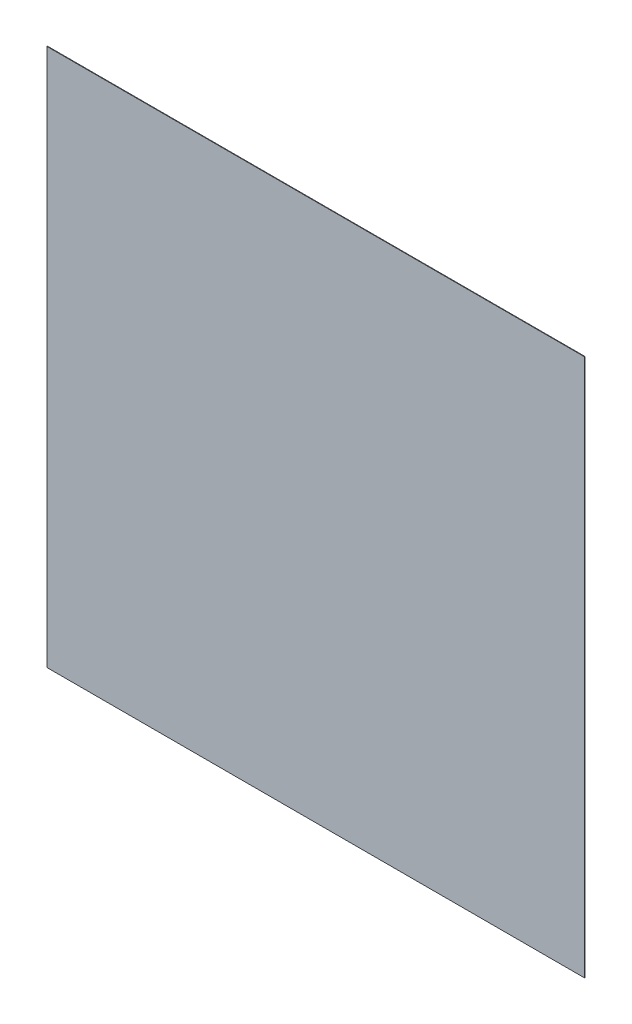
ISO-10303-21;
HEADER;
FILE_DESCRIPTION(('STEP AP214'),'2;1');
FILE_NAME('part.step','',(''),(''),'','','');
FILE_SCHEMA(('AUTOMOTIVE_DESIGN { 1 0 10303 214 1 1 1 1 }'));
ENDSEC;
DATA;
#1=APPLICATION_CONTEXT('core data for automotive mechanical design processes');
#2=APPLICATION_PROTOCOL_DEFINITION('international standard','automotive_design',2000,#1);
#3=PRODUCT_CONTEXT('',#1,'mechanical');
#4=PRODUCT('Part','Part','',(#3));
#5=PRODUCT_RELATED_PRODUCT_CATEGORY('part','',(#4));
#6=PRODUCT_DEFINITION_FORMATION('','',#4);
#7=PRODUCT_DEFINITION_CONTEXT('part definition',#1,'design');
#8=PRODUCT_DEFINITION('design','',#6,#7);
#9=PRODUCT_DEFINITION_SHAPE('','',#8);
#10=(LENGTH_UNIT() NAMED_UNIT(*) SI_UNIT(.MILLI.,.METRE.));
#11=(NAMED_UNIT(*) PLANE_ANGLE_UNIT() SI_UNIT($,.RADIAN.));
#12=(NAMED_UNIT(*) SI_UNIT($,.STERADIAN.) SOLID_ANGLE_UNIT());
#13=UNCERTAINTY_MEASURE_WITH_UNIT(LENGTH_MEASURE(1.E-05),#10,'distance_accuracy_value','');
#14=(GEOMETRIC_REPRESENTATION_CONTEXT(3) GLOBAL_UNCERTAINTY_ASSIGNED_CONTEXT((#13)) GLOBAL_UNIT_ASSIGNED_CONTEXT((#10,
#11,#12)) REPRESENTATION_CONTEXT('',''));
#15=CARTESIAN_POINT('',(0.,0.,0.));
#16=DIRECTION('',(0.,0.,1.));
#17=DIRECTION('',(1.,0.,0.));
#18=AXIS2_PLACEMENT_3D('',#15,#16,#17);
#19=CARTESIAN_POINT('',(5000.,-5000.,10.));
#20=DIRECTION('',(-1.,0.,0.));
#21=DIRECTION('',(0.,0.,1.));
#22=AXIS2_PLACEMENT_3D('',#19,#20,#21);
#23=PLANE('',#22);
#24=DIRECTION('',(0.,1.,0.));
#25=VECTOR('',#24,1.);
#26=CARTESIAN_POINT('',(5000.,-5000.,0.));
#27=LINE('',#26,#25);
#28=CARTESIAN_POINT('',(5000.,-5000.,0.));
#29=VERTEX_POINT('',#28);
#30=CARTESIAN_POINT('',(5000.,5000.,0.));
#31=VERTEX_POINT('',#30);
#32=EDGE_CURVE('E97',#29,#31,#27,.T.);
#33=ORIENTED_EDGE('',*,*,#32,.T.);
#34=DIRECTION('',(0.,0.,-1.));
#35=VECTOR('',#34,1.);
#36=CARTESIAN_POINT('',(5000.,5000.,10.));
#37=LINE('',#36,#35);
#38=CARTESIAN_POINT('',(5000.,5000.,10.));
#39=VERTEX_POINT('',#38);
#40=EDGE_CURVE('E11',#39,#31,#37,.T.);
#41=ORIENTED_EDGE('',*,*,#40,.F.);
#42=DIRECTION('',(0.,1.,0.));
#43=VECTOR('',#42,1.);
#44=CARTESIAN_POINT('',(5000.,-5000.,10.));
#45=LINE('',#44,#43);
#46=CARTESIAN_POINT('',(5000.,-5000.,10.));
#47=VERTEX_POINT('',#46);
#48=EDGE_CURVE('E85',#47,#39,#45,.T.);
#49=ORIENTED_EDGE('',*,*,#48,.F.);
#50=DIRECTION('',(0.,0.,-1.));
#51=VECTOR('',#50,1.);
#52=CARTESIAN_POINT('',(5000.,-5000.,10.));
#53=LINE('',#52,#51);
#54=EDGE_CURVE('E93',#47,#29,#53,.T.);
#55=ORIENTED_EDGE('',*,*,#54,.T.);
#56=EDGE_LOOP('',(#33,#41,#49,#55));
#57=FACE_BOUND('',#56,.T.);
#58=ADVANCED_FACE('F34',(#57),#23,.F.);
#59=CARTESIAN_POINT('',(-5000.,5000.,10.));
#60=DIRECTION('',(0.,-1.,0.));
#61=DIRECTION('',(0.,0.,-1.));
#62=AXIS2_PLACEMENT_3D('',#59,#60,#61);
#63=PLANE('',#62);
#64=DIRECTION('',(-1.,0.,0.));
#65=VECTOR('',#64,1.);
#66=CARTESIAN_POINT('',(-5000.,5000.,0.));
#67=LINE('',#66,#65);
#68=CARTESIAN_POINT('',(-5000.,5000.,0.));
#69=VERTEX_POINT('',#68);
#70=EDGE_CURVE('E89',#31,#69,#67,.T.);
#71=ORIENTED_EDGE('',*,*,#70,.T.);
#72=DIRECTION('',(0.,0.,-1.));
#73=VECTOR('',#72,1.);
#74=CARTESIAN_POINT('',(-5000.,5000.,10.));
#75=LINE('',#74,#73);
#76=CARTESIAN_POINT('',(-5000.,5000.,10.));
#77=VERTEX_POINT('',#76);
#78=EDGE_CURVE('E42',#77,#69,#75,.T.);
#79=ORIENTED_EDGE('',*,*,#78,.F.);
#80=DIRECTION('',(-1.,0.,0.));
#81=VECTOR('',#80,1.);
#82=CARTESIAN_POINT('',(-5000.,5000.,10.));
#83=LINE('',#82,#81);
#84=EDGE_CURVE('E80',#39,#77,#83,.T.);
#85=ORIENTED_EDGE('',*,*,#84,.F.);
#86=ORIENTED_EDGE('',*,*,#40,.T.);
#87=EDGE_LOOP('',(#71,#79,#85,#86));
#88=FACE_BOUND('',#87,.T.);
#89=ADVANCED_FACE('F88',(#88),#63,.F.);
#90=CARTESIAN_POINT('',(-5000.,-5000.,10.));
#91=DIRECTION('',(1.,0.,0.));
#92=DIRECTION('',(0.,0.,-1.));
#93=AXIS2_PLACEMENT_3D('',#90,#91,#92);
#94=PLANE('',#93);
#95=DIRECTION('',(0.,-1.,0.));
#96=VECTOR('',#95,1.);
#97=CARTESIAN_POINT('',(-5000.,-5000.,0.));
#98=LINE('',#97,#96);
#99=CARTESIAN_POINT('',(-5000.,-5000.,0.));
#100=VERTEX_POINT('',#99);
#101=EDGE_CURVE('E67',#69,#100,#98,.T.);
#102=ORIENTED_EDGE('',*,*,#101,.T.);
#103=DIRECTION('',(0.,0.,-1.));
#104=VECTOR('',#103,1.);
#105=CARTESIAN_POINT('',(-5000.,-5000.,10.));
#106=LINE('',#105,#104);
#107=CARTESIAN_POINT('',(-5000.,-5000.,10.));
#108=VERTEX_POINT('',#107);
#109=EDGE_CURVE('E90',#108,#100,#106,.T.);
#110=ORIENTED_EDGE('',*,*,#109,.F.);
#111=DIRECTION('',(0.,-1.,0.));
#112=VECTOR('',#111,1.);
#113=CARTESIAN_POINT('',(-5000.,-5000.,10.));
#114=LINE('',#113,#112);
#115=EDGE_CURVE('E83',#77,#108,#114,.T.);
#116=ORIENTED_EDGE('',*,*,#115,.F.);
#117=ORIENTED_EDGE('',*,*,#78,.T.);
#118=EDGE_LOOP('',(#102,#110,#116,#117));
#119=FACE_BOUND('',#118,.T.);
#120=ADVANCED_FACE('F91',(#119),#94,.F.);
#121=CARTESIAN_POINT('',(-5000.,-5000.,10.));
#122=DIRECTION('',(0.,1.,0.));
#123=DIRECTION('',(0.,0.,1.));
#124=AXIS2_PLACEMENT_3D('',#121,#122,#123);
#125=PLANE('',#124);
#126=DIRECTION('',(1.,0.,0.));
#127=VECTOR('',#126,1.);
#128=CARTESIAN_POINT('',(-5000.,-5000.,0.));
#129=LINE('',#128,#127);
#130=EDGE_CURVE('E73',#100,#29,#129,.T.);
#131=ORIENTED_EDGE('',*,*,#130,.T.);
#132=ORIENTED_EDGE('',*,*,#54,.F.);
#133=DIRECTION('',(1.,0.,0.));
#134=VECTOR('',#133,1.);
#135=CARTESIAN_POINT('',(-5000.,-5000.,10.));
#136=LINE('',#135,#134);
#137=EDGE_CURVE('E50',#108,#47,#136,.T.);
#138=ORIENTED_EDGE('',*,*,#137,.F.);
#139=ORIENTED_EDGE('',*,*,#109,.T.);
#140=EDGE_LOOP('',(#131,#132,#138,#139));
#141=FACE_BOUND('',#140,.T.);
#142=ADVANCED_FACE('F104',(#141),#125,.F.);
#143=CARTESIAN_POINT('',(0.,0.,10.));
#144=DIRECTION('',(0.,0.,-1.));
#145=DIRECTION('',(-1.,0.,0.));
#146=AXIS2_PLACEMENT_3D('',#143,#144,#145);
#147=PLANE('',#146);
#148=ORIENTED_EDGE('',*,*,#48,.T.);
#149=ORIENTED_EDGE('',*,*,#84,.T.);
#150=ORIENTED_EDGE('',*,*,#115,.T.);
#151=ORIENTED_EDGE('',*,*,#137,.T.);
#152=EDGE_LOOP('',(#148,#149,#150,#151));
#153=FACE_BOUND('',#152,.T.);
#154=ADVANCED_FACE('F81',(#153),#147,.F.);
#155=CARTESIAN_POINT('',(0.,0.,0.));
#156=DIRECTION('',(0.,0.,-1.));
#157=DIRECTION('',(-1.,0.,0.));
#158=AXIS2_PLACEMENT_3D('',#155,#156,#157);
#159=PLANE('',#158);
#160=ORIENTED_EDGE('',*,*,#32,.F.);
#161=ORIENTED_EDGE('',*,*,#130,.F.);
#162=ORIENTED_EDGE('',*,*,#101,.F.);
#163=ORIENTED_EDGE('',*,*,#70,.F.);
#164=EDGE_LOOP('',(#160,#161,#162,#163));
#165=FACE_BOUND('',#164,.T.);
#166=ADVANCED_FACE('F107',(#165),#159,.T.);
#167=CLOSED_SHELL('',(#58,#89,#120,#142,#154,#166));
#168=MANIFOLD_SOLID_BREP('B2',#167);
#169=ADVANCED_BREP_SHAPE_REPRESENTATION('',(#18,#168),#14);
#170=SHAPE_DEFINITION_REPRESENTATION(#9,#169);
ENDSEC;
END-ISO-10303-21;
